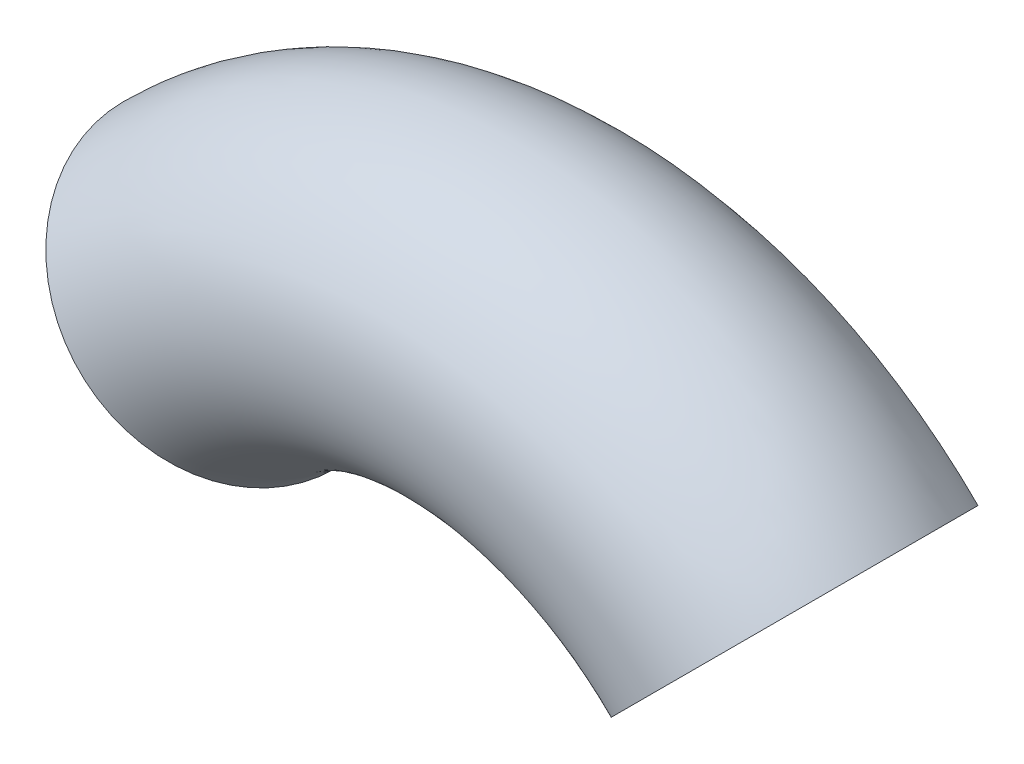
ISO-10303-21;
HEADER;
FILE_DESCRIPTION(('STEP AP214'),'2;1');
FILE_NAME('part.step','',(''),(''),'','','');
FILE_SCHEMA(('AUTOMOTIVE_DESIGN { 1 0 10303 214 1 1 1 1 }'));
ENDSEC;
DATA;
#1=APPLICATION_CONTEXT('core data for automotive mechanical design processes');
#2=APPLICATION_PROTOCOL_DEFINITION('international standard','automotive_design',2000,#1);
#3=PRODUCT_CONTEXT('',#1,'mechanical');
#4=PRODUCT('Part','Part','',(#3));
#5=PRODUCT_RELATED_PRODUCT_CATEGORY('part','',(#4));
#6=PRODUCT_DEFINITION_FORMATION('','',#4);
#7=PRODUCT_DEFINITION_CONTEXT('part definition',#1,'design');
#8=PRODUCT_DEFINITION('design','',#6,#7);
#9=PRODUCT_DEFINITION_SHAPE('','',#8);
#10=(LENGTH_UNIT() NAMED_UNIT(*) SI_UNIT(.MILLI.,.METRE.));
#11=(NAMED_UNIT(*) PLANE_ANGLE_UNIT() SI_UNIT($,.RADIAN.));
#12=(NAMED_UNIT(*) SI_UNIT($,.STERADIAN.) SOLID_ANGLE_UNIT());
#13=UNCERTAINTY_MEASURE_WITH_UNIT(LENGTH_MEASURE(1.E-05),#10,'distance_accuracy_value','');
#14=(GEOMETRIC_REPRESENTATION_CONTEXT(3) GLOBAL_UNCERTAINTY_ASSIGNED_CONTEXT((#13)) GLOBAL_UNIT_ASSIGNED_CONTEXT((#10,
#11,#12)) REPRESENTATION_CONTEXT('',''));
#15=CARTESIAN_POINT('',(0.,0.,0.));
#16=DIRECTION('',(0.,0.,1.));
#17=DIRECTION('',(1.,0.,0.));
#18=AXIS2_PLACEMENT_3D('',#15,#16,#17);
#19=CARTESIAN_POINT('',(0.,0.,0.));
#20=DIRECTION('',(0.,0.,1.));
#21=DIRECTION('',(1.,0.,0.));
#22=AXIS2_PLACEMENT_3D('',#19,#20,#21);
#23=TOROIDAL_SURFACE('',#22,63.5,23.8125);
#24=CARTESIAN_POINT('',(44.9012806053458,44.9012806053457,0.));
#25=DIRECTION('',(-0.707106781186547,0.707106781186548,0.));
#26=DIRECTION('',(-0.707106781186548,-0.707106781186547,0.));
#27=AXIS2_PLACEMENT_3D('',#24,#25,#26);
#28=CIRCLE('',#27,23.8125);
#29=CARTESIAN_POINT('',(61.7392608323505,61.7392608323503,0.));
#30=VERTEX_POINT('',#29);
#31=EDGE_CURVE('E10',#30,#30,#28,.T.);
#32=CARTESIAN_POINT('',(-44.9012806053459,44.9012806053457,0.));
#33=DIRECTION('',(-0.707106781186546,-0.707106781186549,0.));
#34=DIRECTION('',(0.707106781186549,-0.707106781186546,0.));
#35=AXIS2_PLACEMENT_3D('',#32,#33,#34);
#36=CIRCLE('',#35,23.8125);
#37=CARTESIAN_POINT('',(-61.7392608323505,61.7392608323503,0.));
#38=VERTEX_POINT('',#37);
#39=EDGE_CURVE('E38',#38,#38,#36,.T.);
#40=CARTESIAN_POINT('',(0.,0.,0.));
#41=DIRECTION('',(0.,0.,1.));
#42=DIRECTION('',(1.,0.,0.));
#43=AXIS2_PLACEMENT_3D('',#40,#41,#42);
#44=CIRCLE('',#43,87.3125);
#45=EDGE_CURVE('',#30,#38,#44,.T.);
#46=ORIENTED_EDGE('',*,*,#31,.T.);
#47=ORIENTED_EDGE('',*,*,#39,.F.);
#48=ORIENTED_EDGE('',*,*,#45,.T.);
#49=ORIENTED_EDGE('',*,*,#45,.F.);
#50=EDGE_LOOP('',(#46,#48,#47,#49));
#51=FACE_BOUND('',#50,.T.);
#52=ADVANCED_FACE('F32',(#51),#23,.T.);
#53=CARTESIAN_POINT('',(44.9012806053458,44.9012806053457,0.));
#54=DIRECTION('',(-0.707106781186547,0.707106781186548,0.));
#55=DIRECTION('',(-0.707106781186548,-0.707106781186547,0.));
#56=AXIS2_PLACEMENT_3D('',#53,#54,#55);
#57=PLANE('',#56);
#58=CARTESIAN_POINT('',(44.9012806053458,44.9012806053457,0.));
#59=DIRECTION('',(-0.707106781186547,0.707106781186548,0.));
#60=DIRECTION('',(-0.707106781186548,-0.707106781186547,0.));
#61=AXIS2_PLACEMENT_3D('',#58,#59,#60);
#62=CIRCLE('',#61,22.5679);
#63=CARTESIAN_POINT('',(60.8591957324857,60.8591957324856,0.));
#64=VERTEX_POINT('',#63);
#65=EDGE_CURVE('E42',#64,#64,#62,.T.);
#66=ORIENTED_EDGE('',*,*,#65,.T.);
#67=EDGE_LOOP('',(#66));
#68=FACE_BOUND('',#67,.T.);
#69=ORIENTED_EDGE('',*,*,#31,.F.);
#70=EDGE_LOOP('',(#69));
#71=FACE_BOUND('',#70,.T.);
#72=ADVANCED_FACE('F56',(#68,#71),#57,.F.);
#73=CARTESIAN_POINT('',(-44.9012806053459,44.9012806053457,0.));
#74=DIRECTION('',(-0.707106781186546,-0.707106781186549,0.));
#75=DIRECTION('',(0.707106781186549,-0.707106781186546,0.));
#76=AXIS2_PLACEMENT_3D('',#73,#74,#75);
#77=PLANE('',#76);
#78=CARTESIAN_POINT('',(-44.9012806053459,44.9012806053457,0.));
#79=DIRECTION('',(-0.707106781186546,-0.707106781186549,0.));
#80=DIRECTION('',(0.707106781186549,-0.707106781186546,0.));
#81=AXIS2_PLACEMENT_3D('',#78,#79,#80);
#82=CIRCLE('',#81,22.5679);
#83=CARTESIAN_POINT('',(-60.8591957324858,60.8591957324856,0.));
#84=VERTEX_POINT('',#83);
#85=EDGE_CURVE('E46',#84,#84,#82,.T.);
#86=ORIENTED_EDGE('',*,*,#85,.F.);
#87=EDGE_LOOP('',(#86));
#88=FACE_BOUND('',#87,.T.);
#89=ORIENTED_EDGE('',*,*,#39,.T.);
#90=EDGE_LOOP('',(#89));
#91=FACE_BOUND('',#90,.T.);
#92=ADVANCED_FACE('F54',(#88,#91),#77,.T.);
#93=CARTESIAN_POINT('',(0.,0.,0.));
#94=DIRECTION('',(0.,0.,1.));
#95=DIRECTION('',(1.,0.,0.));
#96=AXIS2_PLACEMENT_3D('',#93,#94,#95);
#97=TOROIDAL_SURFACE('',#96,63.5,22.5679);
#98=CARTESIAN_POINT('',(0.,0.,0.));
#99=DIRECTION('',(0.,0.,1.));
#100=DIRECTION('',(1.,0.,0.));
#101=AXIS2_PLACEMENT_3D('',#98,#99,#100);
#102=CIRCLE('',#101,86.0679);
#103=EDGE_CURVE('',#64,#84,#102,.T.);
#104=ORIENTED_EDGE('',*,*,#65,.F.);
#105=ORIENTED_EDGE('',*,*,#85,.T.);
#106=ORIENTED_EDGE('',*,*,#103,.T.);
#107=ORIENTED_EDGE('',*,*,#103,.F.);
#108=EDGE_LOOP('',(#104,#106,#105,#107));
#109=FACE_BOUND('',#108,.T.);
#110=ADVANCED_FACE('F52',(#109),#97,.F.);
#111=CLOSED_SHELL('',(#52,#72,#92,#110));
#112=MANIFOLD_SOLID_BREP('B2',#111);
#113=ADVANCED_BREP_SHAPE_REPRESENTATION('',(#18,#112),#14);
#114=SHAPE_DEFINITION_REPRESENTATION(#9,#113);
ENDSEC;
END-ISO-10303-21;
